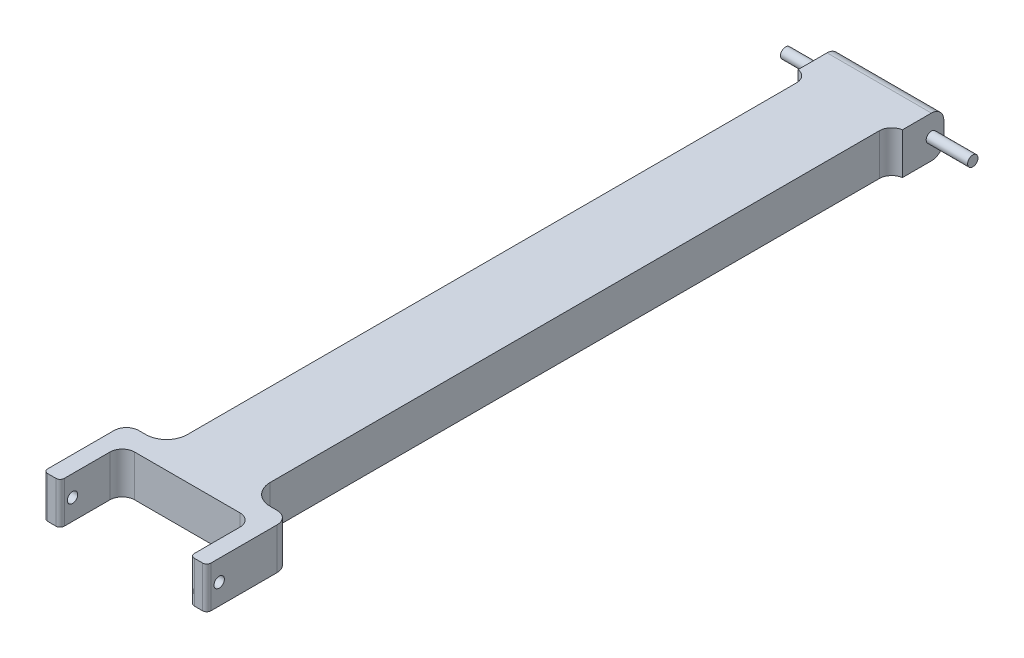
ISO-10303-21;
HEADER;
FILE_DESCRIPTION(('STEP AP214'),'2;1');
FILE_NAME('part.step','',(''),(''),'','','');
FILE_SCHEMA(('AUTOMOTIVE_DESIGN { 1 0 10303 214 1 1 1 1 }'));
ENDSEC;
DATA;
#1=APPLICATION_CONTEXT('core data for automotive mechanical design processes');
#2=APPLICATION_PROTOCOL_DEFINITION('international standard','automotive_design',2000,#1);
#3=PRODUCT_CONTEXT('',#1,'mechanical');
#4=PRODUCT('Part','Part','',(#3));
#5=PRODUCT_RELATED_PRODUCT_CATEGORY('part','',(#4));
#6=PRODUCT_DEFINITION_FORMATION('','',#4);
#7=PRODUCT_DEFINITION_CONTEXT('part definition',#1,'design');
#8=PRODUCT_DEFINITION('design','',#6,#7);
#9=PRODUCT_DEFINITION_SHAPE('','',#8);
#10=(LENGTH_UNIT() NAMED_UNIT(*) SI_UNIT(.MILLI.,.METRE.));
#11=(NAMED_UNIT(*) PLANE_ANGLE_UNIT() SI_UNIT($,.RADIAN.));
#12=(NAMED_UNIT(*) SI_UNIT($,.STERADIAN.) SOLID_ANGLE_UNIT());
#13=UNCERTAINTY_MEASURE_WITH_UNIT(LENGTH_MEASURE(1.E-05),#10,'distance_accuracy_value','');
#14=(GEOMETRIC_REPRESENTATION_CONTEXT(3) GLOBAL_UNCERTAINTY_ASSIGNED_CONTEXT((#13)) GLOBAL_UNIT_ASSIGNED_CONTEXT((#10,
#11,#12)) REPRESENTATION_CONTEXT('',''));
#15=CARTESIAN_POINT('',(0.,0.,0.));
#16=DIRECTION('',(0.,0.,1.));
#17=DIRECTION('',(1.,0.,0.));
#18=AXIS2_PLACEMENT_3D('',#15,#16,#17);
#19=CARTESIAN_POINT('',(29.695,10.,-165.));
#20=DIRECTION('',(-1.,0.,0.));
#21=DIRECTION('',(0.,0.,1.));
#22=AXIS2_PLACEMENT_3D('',#19,#20,#21);
#23=PLANE('',#22);
#24=DIRECTION('',(0.,0.,1.));
#25=VECTOR('',#24,1.);
#26=CARTESIAN_POINT('',(29.695,0.,-165.));
#27=LINE('',#26,#25);
#28=CARTESIAN_POINT('',(29.695,0.,-152.028148725121));
#29=VERTEX_POINT('',#28);
#30=CARTESIAN_POINT('',(29.695,0.,-5.));
#31=VERTEX_POINT('',#30);
#32=EDGE_CURVE('E335',#29,#31,#27,.T.);
#33=ORIENTED_EDGE('',*,*,#32,.F.);
#34=DIRECTION('',(0.,1.,0.));
#35=VECTOR('',#34,1.);
#36=CARTESIAN_POINT('',(29.695,10.,-152.028148725121));
#37=LINE('',#36,#35);
#38=CARTESIAN_POINT('',(29.695,10.,-152.028148725121));
#39=VERTEX_POINT('',#38);
#40=EDGE_CURVE('E548',#29,#39,#37,.T.);
#41=ORIENTED_EDGE('',*,*,#40,.T.);
#42=DIRECTION('',(0.,0.,1.));
#43=VECTOR('',#42,1.);
#44=CARTESIAN_POINT('',(29.695,10.,-165.));
#45=LINE('',#44,#43);
#46=CARTESIAN_POINT('',(29.695,10.,-5.));
#47=VERTEX_POINT('',#46);
#48=EDGE_CURVE('E298',#39,#47,#45,.T.);
#49=ORIENTED_EDGE('',*,*,#48,.T.);
#50=DIRECTION('',(0.,-1.,0.));
#51=VECTOR('',#50,1.);
#52=CARTESIAN_POINT('',(29.695,10.,-5.));
#53=LINE('',#52,#51);
#54=EDGE_CURVE('E525',#47,#31,#53,.T.);
#55=ORIENTED_EDGE('',*,*,#54,.T.);
#56=EDGE_LOOP('',(#33,#41,#49,#55));
#57=FACE_BOUND('',#56,.T.);
#58=ADVANCED_FACE('F38',(#57),#23,.F.);
#59=CARTESIAN_POINT('',(9.695,10.,-165.));
#60=DIRECTION('',(1.,0.,0.));
#61=DIRECTION('',(0.,0.,-1.));
#62=AXIS2_PLACEMENT_3D('',#59,#60,#61);
#63=PLANE('',#62);
#64=DIRECTION('',(0.,0.,1.));
#65=VECTOR('',#64,1.);
#66=CARTESIAN_POINT('',(9.695,10.,-165.));
#67=LINE('',#66,#65);
#68=CARTESIAN_POINT('',(9.695,10.,-152.028148725121));
#69=VERTEX_POINT('',#68);
#70=CARTESIAN_POINT('',(9.695,10.,-5.));
#71=VERTEX_POINT('',#70);
#72=EDGE_CURVE('E329',#69,#71,#67,.T.);
#73=ORIENTED_EDGE('',*,*,#72,.F.);
#74=DIRECTION('',(0.,-1.,0.));
#75=VECTOR('',#74,1.);
#76=CARTESIAN_POINT('',(9.695,10.,-152.028148725121));
#77=LINE('',#76,#75);
#78=CARTESIAN_POINT('',(9.695,0.,-152.028148725121));
#79=VERTEX_POINT('',#78);
#80=EDGE_CURVE('E545',#69,#79,#77,.T.);
#81=ORIENTED_EDGE('',*,*,#80,.T.);
#82=DIRECTION('',(0.,0.,1.));
#83=VECTOR('',#82,1.);
#84=CARTESIAN_POINT('',(9.695,0.,-165.));
#85=LINE('',#84,#83);
#86=CARTESIAN_POINT('',(9.695,0.,-5.));
#87=VERTEX_POINT('',#86);
#88=EDGE_CURVE('E332',#79,#87,#85,.T.);
#89=ORIENTED_EDGE('',*,*,#88,.T.);
#90=DIRECTION('',(0.,1.,0.));
#91=VECTOR('',#90,1.);
#92=CARTESIAN_POINT('',(9.695,10.,-5.));
#93=LINE('',#92,#91);
#94=EDGE_CURVE('E518',#87,#71,#93,.T.);
#95=ORIENTED_EDGE('',*,*,#94,.T.);
#96=EDGE_LOOP('',(#73,#81,#89,#95));
#97=FACE_BOUND('',#96,.T.);
#98=ADVANCED_FACE('F631',(#97),#63,.F.);
#99=CARTESIAN_POINT('',(0.,0.,0.));
#100=DIRECTION('',(0.,0.,-1.));
#101=DIRECTION('',(-1.,0.,0.));
#102=AXIS2_PLACEMENT_3D('',#99,#100,#101);
#103=PLANE('',#102);
#104=DIRECTION('',(1.,0.,0.));
#105=VECTOR('',#104,1.);
#106=CARTESIAN_POINT('',(0.,0.,0.));
#107=LINE('',#106,#105);
#108=CARTESIAN_POINT('',(34.695,0.,0.));
#109=VERTEX_POINT('',#108);
#110=CARTESIAN_POINT('',(36.39,0.,0.));
#111=VERTEX_POINT('',#110);
#112=EDGE_CURVE('E364',#109,#111,#107,.T.);
#113=ORIENTED_EDGE('',*,*,#112,.F.);
#114=DIRECTION('',(0.,-1.,0.));
#115=VECTOR('',#114,1.);
#116=CARTESIAN_POINT('',(34.695,0.,0.));
#117=LINE('',#116,#115);
#118=CARTESIAN_POINT('',(34.695,10.,0.));
#119=VERTEX_POINT('',#118);
#120=EDGE_CURVE('E529',#109,#119,#117,.F.);
#121=ORIENTED_EDGE('',*,*,#120,.T.);
#122=DIRECTION('',(-1.,0.,0.));
#123=VECTOR('',#122,1.);
#124=CARTESIAN_POINT('',(0.,10.,0.));
#125=LINE('',#124,#123);
#126=CARTESIAN_POINT('',(36.39,10.,0.));
#127=VERTEX_POINT('',#126);
#128=EDGE_CURVE('E381',#127,#119,#125,.T.);
#129=ORIENTED_EDGE('',*,*,#128,.F.);
#130=DIRECTION('',(0.,1.,0.));
#131=VECTOR('',#130,1.);
#132=CARTESIAN_POINT('',(36.39,0.,0.));
#133=LINE('',#132,#131);
#134=EDGE_CURVE('E425',#127,#111,#133,.F.);
#135=ORIENTED_EDGE('',*,*,#134,.T.);
#136=EDGE_LOOP('',(#113,#121,#129,#135));
#137=FACE_BOUND('',#136,.T.);
#138=ADVANCED_FACE('F637',(#137),#103,.T.);
#139=CARTESIAN_POINT('',(4.695,10.,0.));
#140=VERTEX_POINT('',#139);
#141=CARTESIAN_POINT('',(3.00000000000001,10.,0.));
#142=VERTEX_POINT('',#141);
#143=EDGE_CURVE('E392',#140,#142,#125,.T.);
#144=ORIENTED_EDGE('',*,*,#143,.F.);
#145=DIRECTION('',(0.,1.,0.));
#146=VECTOR('',#145,1.);
#147=CARTESIAN_POINT('',(4.695,0.,0.));
#148=LINE('',#147,#146);
#149=CARTESIAN_POINT('',(4.695,0.,0.));
#150=VERTEX_POINT('',#149);
#151=EDGE_CURVE('E522',#140,#150,#148,.F.);
#152=ORIENTED_EDGE('',*,*,#151,.T.);
#153=CARTESIAN_POINT('',(3.,0.,0.));
#154=VERTEX_POINT('',#153);
#155=EDGE_CURVE('E388',#154,#150,#107,.T.);
#156=ORIENTED_EDGE('',*,*,#155,.F.);
#157=DIRECTION('',(0.,-1.,0.));
#158=VECTOR('',#157,1.);
#159=CARTESIAN_POINT('',(3.00000000000001,10.,0.));
#160=LINE('',#159,#158);
#161=EDGE_CURVE('E421',#154,#142,#160,.F.);
#162=ORIENTED_EDGE('',*,*,#161,.T.);
#163=EDGE_LOOP('',(#144,#152,#156,#162));
#164=FACE_BOUND('',#163,.T.);
#165=ADVANCED_FACE('F668',(#164),#103,.T.);
#166=CARTESIAN_POINT('',(0.,0.,20.));
#167=DIRECTION('',(0.,0.,-1.));
#168=DIRECTION('',(-1.,0.,0.));
#169=AXIS2_PLACEMENT_3D('',#166,#167,#168);
#170=PLANE('',#169);
#171=DIRECTION('',(-1.,0.,0.));
#172=VECTOR('',#171,1.);
#173=CARTESIAN_POINT('',(0.,10.,20.));
#174=LINE('',#173,#172);
#175=CARTESIAN_POINT('',(3.,10.,20.));
#176=VERTEX_POINT('',#175);
#177=CARTESIAN_POINT('',(1.00000000000001,10.,20.));
#178=VERTEX_POINT('',#177);
#179=EDGE_CURVE('E387',#176,#178,#174,.T.);
#180=ORIENTED_EDGE('',*,*,#179,.T.);
#181=DIRECTION('',(0.,-1.,0.));
#182=VECTOR('',#181,1.);
#183=CARTESIAN_POINT('',(1.,0.,20.));
#184=LINE('',#183,#182);
#185=CARTESIAN_POINT('',(1.,0.,20.));
#186=VERTEX_POINT('',#185);
#187=EDGE_CURVE('E469',#178,#186,#184,.T.);
#188=ORIENTED_EDGE('',*,*,#187,.T.);
#189=DIRECTION('',(1.,0.,0.));
#190=VECTOR('',#189,1.);
#191=CARTESIAN_POINT('',(0.,0.,20.));
#192=LINE('',#191,#190);
#193=CARTESIAN_POINT('',(3.,0.,20.));
#194=VERTEX_POINT('',#193);
#195=EDGE_CURVE('E380',#186,#194,#192,.T.);
#196=ORIENTED_EDGE('',*,*,#195,.T.);
#197=DIRECTION('',(0.,-1.,0.));
#198=VECTOR('',#197,1.);
#199=CARTESIAN_POINT('',(3.,0.,20.));
#200=LINE('',#199,#198);
#201=EDGE_CURVE('E466',#194,#176,#200,.F.);
#202=ORIENTED_EDGE('',*,*,#201,.T.);
#203=EDGE_LOOP('',(#180,#188,#196,#202));
#204=FACE_BOUND('',#203,.T.);
#205=ADVANCED_FACE('F665',(#204),#170,.F.);
#206=CARTESIAN_POINT('',(0.,0.,20.));
#207=DIRECTION('',(1.,0.,0.));
#208=DIRECTION('',(0.,1.,0.));
#209=AXIS2_PLACEMENT_3D('',#206,#207,#208);
#210=PLANE('',#209);
#211=CARTESIAN_POINT('',(0.,5.,17.));
#212=DIRECTION('',(1.,0.,0.));
#213=DIRECTION('',(0.,1.,0.));
#214=AXIS2_PLACEMENT_3D('',#211,#212,#213);
#215=CIRCLE('',#214,1.25);
#216=CARTESIAN_POINT('',(0.,6.25,17.));
#217=VERTEX_POINT('',#216);
#218=EDGE_CURVE('E347',#217,#217,#215,.T.);
#219=ORIENTED_EDGE('',*,*,#218,.T.);
#220=EDGE_LOOP('',(#219));
#221=FACE_BOUND('',#220,.T.);
#222=DIRECTION('',(0.,0.,-1.));
#223=VECTOR('',#222,1.);
#224=CARTESIAN_POINT('',(0.,0.,20.));
#225=LINE('',#224,#223);
#226=CARTESIAN_POINT('',(0.,0.,19.));
#227=VERTEX_POINT('',#226);
#228=CARTESIAN_POINT('',(0.,0.,3.));
#229=VERTEX_POINT('',#228);
#230=EDGE_CURVE('E404',#227,#229,#225,.T.);
#231=ORIENTED_EDGE('',*,*,#230,.F.);
#232=DIRECTION('',(0.,-1.,0.));
#233=VECTOR('',#232,1.);
#234=CARTESIAN_POINT('',(0.,0.,19.));
#235=LINE('',#234,#233);
#236=CARTESIAN_POINT('',(0.,10.,19.));
#237=VERTEX_POINT('',#236);
#238=EDGE_CURVE('E485',#227,#237,#235,.F.);
#239=ORIENTED_EDGE('',*,*,#238,.T.);
#240=DIRECTION('',(0.,0.,-1.));
#241=VECTOR('',#240,1.);
#242=CARTESIAN_POINT('',(0.,10.,20.));
#243=LINE('',#242,#241);
#244=CARTESIAN_POINT('',(0.,10.,3.));
#245=VERTEX_POINT('',#244);
#246=EDGE_CURVE('E386',#237,#245,#243,.T.);
#247=ORIENTED_EDGE('',*,*,#246,.T.);
#248=DIRECTION('',(0.,-1.,0.));
#249=VECTOR('',#248,1.);
#250=CARTESIAN_POINT('',(0.,0.,3.));
#251=LINE('',#250,#249);
#252=EDGE_CURVE('E436',#245,#229,#251,.T.);
#253=ORIENTED_EDGE('',*,*,#252,.T.);
#254=EDGE_LOOP('',(#231,#239,#247,#253));
#255=FACE_BOUND('',#254,.T.);
#256=ADVANCED_FACE('F679',(#221,#255),#210,.F.);
#257=CARTESIAN_POINT('',(0.,0.,20.));
#258=DIRECTION('',(0.,1.,0.));
#259=DIRECTION('',(0.,0.,1.));
#260=AXIS2_PLACEMENT_3D('',#257,#258,#259);
#261=PLANE('',#260);
#262=DIRECTION('',(0.,0.,1.));
#263=VECTOR('',#262,1.);
#264=CARTESIAN_POINT('',(7.105,0.,-165.));
#265=LINE('',#264,#263);
#266=CARTESIAN_POINT('',(7.105,0.,-162.));
#267=VERTEX_POINT('',#266);
#268=CARTESIAN_POINT('',(7.105,0.,-155.));
#269=VERTEX_POINT('',#268);
#270=EDGE_CURVE('E317',#267,#269,#265,.T.);
#271=ORIENTED_EDGE('',*,*,#270,.F.);
#272=DIRECTION('',(-1.,0.,0.));
#273=VECTOR('',#272,1.);
#274=CARTESIAN_POINT('',(32.285,0.,-162.));
#275=LINE('',#274,#273);
#276=CARTESIAN_POINT('',(32.285,0.,-162.));
#277=VERTEX_POINT('',#276);
#278=EDGE_CURVE('E578',#267,#277,#275,.F.);
#279=ORIENTED_EDGE('',*,*,#278,.T.);
#280=DIRECTION('',(0.,0.,-1.));
#281=VECTOR('',#280,1.);
#282=CARTESIAN_POINT('',(32.285,0.,-165.));
#283=LINE('',#282,#281);
#284=CARTESIAN_POINT('',(32.285,0.,-155.));
#285=VERTEX_POINT('',#284);
#286=EDGE_CURVE('E307',#285,#277,#283,.T.);
#287=ORIENTED_EDGE('',*,*,#286,.F.);
#288=CARTESIAN_POINT('',(32.695,0.,-152.028148725121));
#289=DIRECTION('',(0.,1.,0.));
#290=DIRECTION('',(0.,0.,1.));
#291=AXIS2_PLACEMENT_3D('',#288,#289,#290);
#292=CIRCLE('',#291,3.);
#293=EDGE_CURVE('E303',#285,#29,#292,.T.);
#294=ORIENTED_EDGE('',*,*,#293,.T.);
#295=ORIENTED_EDGE('',*,*,#32,.T.);
#296=CARTESIAN_POINT('',(34.695,0.,-5.));
#297=DIRECTION('',(0.,1.,0.));
#298=DIRECTION('',(0.,0.,1.));
#299=AXIS2_PLACEMENT_3D('',#296,#297,#298);
#300=CIRCLE('',#299,5.);
#301=EDGE_CURVE('E539',#31,#109,#300,.T.);
#302=ORIENTED_EDGE('',*,*,#301,.T.);
#303=ORIENTED_EDGE('',*,*,#112,.T.);
#304=CARTESIAN_POINT('',(36.39,0.,3.));
#305=DIRECTION('',(0.,1.,0.));
#306=DIRECTION('',(0.,0.,1.));
#307=AXIS2_PLACEMENT_3D('',#304,#305,#306);
#308=CIRCLE('',#307,3.);
#309=CARTESIAN_POINT('',(39.39,0.,3.));
#310=VERTEX_POINT('',#309);
#311=EDGE_CURVE('E432',#111,#310,#308,.F.);
#312=ORIENTED_EDGE('',*,*,#311,.T.);
#313=DIRECTION('',(0.,0.,-1.));
#314=VECTOR('',#313,1.);
#315=CARTESIAN_POINT('',(39.39,0.,20.));
#316=LINE('',#315,#314);
#317=CARTESIAN_POINT('',(39.39,0.,19.));
#318=VERTEX_POINT('',#317);
#319=EDGE_CURVE('E401',#318,#310,#316,.T.);
#320=ORIENTED_EDGE('',*,*,#319,.F.);
#321=CARTESIAN_POINT('',(38.39,0.,19.));
#322=DIRECTION('',(0.,1.,0.));
#323=DIRECTION('',(0.,0.,1.));
#324=AXIS2_PLACEMENT_3D('',#321,#322,#323);
#325=CIRCLE('',#324,1.);
#326=CARTESIAN_POINT('',(38.39,0.,20.));
#327=VERTEX_POINT('',#326);
#328=EDGE_CURVE('E473',#318,#327,#325,.F.);
#329=ORIENTED_EDGE('',*,*,#328,.T.);
#330=CARTESIAN_POINT('',(36.39,0.,20.));
#331=VERTEX_POINT('',#330);
#332=EDGE_CURVE('E376',#331,#327,#192,.T.);
#333=ORIENTED_EDGE('',*,*,#332,.F.);
#334=CARTESIAN_POINT('',(36.39,0.,19.));
#335=DIRECTION('',(0.,1.,0.));
#336=DIRECTION('',(0.,0.,1.));
#337=AXIS2_PLACEMENT_3D('',#334,#335,#336);
#338=CIRCLE('',#337,1.);
#339=CARTESIAN_POINT('',(35.39,0.,19.));
#340=VERTEX_POINT('',#339);
#341=EDGE_CURVE('E476',#331,#340,#338,.F.);
#342=ORIENTED_EDGE('',*,*,#341,.T.);
#343=DIRECTION('',(0.,0.,1.));
#344=VECTOR('',#343,1.);
#345=CARTESIAN_POINT('',(35.39,0.,5.));
#346=LINE('',#345,#344);
#347=CARTESIAN_POINT('',(35.39,0.,8.));
#348=VERTEX_POINT('',#347);
#349=EDGE_CURVE('E369',#348,#340,#346,.T.);
#350=ORIENTED_EDGE('',*,*,#349,.F.);
#351=CARTESIAN_POINT('',(32.39,0.,8.));
#352=DIRECTION('',(0.,1.,0.));
#353=DIRECTION('',(0.,0.,1.));
#354=AXIS2_PLACEMENT_3D('',#351,#352,#353);
#355=CIRCLE('',#354,3.);
#356=CARTESIAN_POINT('',(32.39,0.,5.));
#357=VERTEX_POINT('',#356);
#358=EDGE_CURVE('E463',#348,#357,#355,.T.);
#359=ORIENTED_EDGE('',*,*,#358,.T.);
#360=DIRECTION('',(1.,0.,0.));
#361=VECTOR('',#360,1.);
#362=CARTESIAN_POINT('',(4.,0.,5.));
#363=LINE('',#362,#361);
#364=CARTESIAN_POINT('',(7.,0.,5.));
#365=VERTEX_POINT('',#364);
#366=EDGE_CURVE('E351',#365,#357,#363,.T.);
#367=ORIENTED_EDGE('',*,*,#366,.F.);
#368=CARTESIAN_POINT('',(7.,0.,8.));
#369=DIRECTION('',(0.,1.,0.));
#370=DIRECTION('',(0.,0.,1.));
#371=AXIS2_PLACEMENT_3D('',#368,#369,#370);
#372=CIRCLE('',#371,3.);
#373=CARTESIAN_POINT('',(4.,0.,8.));
#374=VERTEX_POINT('',#373);
#375=EDGE_CURVE('E454',#365,#374,#372,.T.);
#376=ORIENTED_EDGE('',*,*,#375,.T.);
#377=DIRECTION('',(0.,0.,1.));
#378=VECTOR('',#377,1.);
#379=CARTESIAN_POINT('',(4.,0.,5.));
#380=LINE('',#379,#378);
#381=CARTESIAN_POINT('',(4.,0.,19.));
#382=VERTEX_POINT('',#381);
#383=EDGE_CURVE('E359',#374,#382,#380,.T.);
#384=ORIENTED_EDGE('',*,*,#383,.T.);
#385=CARTESIAN_POINT('',(3.,0.,19.));
#386=DIRECTION('',(0.,1.,0.));
#387=DIRECTION('',(0.,0.,1.));
#388=AXIS2_PLACEMENT_3D('',#385,#386,#387);
#389=CIRCLE('',#388,1.);
#390=EDGE_CURVE('E479',#382,#194,#389,.F.);
#391=ORIENTED_EDGE('',*,*,#390,.T.);
#392=ORIENTED_EDGE('',*,*,#195,.F.);
#393=CARTESIAN_POINT('',(1.,0.,19.));
#394=DIRECTION('',(0.,1.,0.));
#395=DIRECTION('',(0.,0.,1.));
#396=AXIS2_PLACEMENT_3D('',#393,#394,#395);
#397=CIRCLE('',#396,1.);
#398=EDGE_CURVE('E482',#186,#227,#397,.F.);
#399=ORIENTED_EDGE('',*,*,#398,.T.);
#400=ORIENTED_EDGE('',*,*,#230,.T.);
#401=CARTESIAN_POINT('',(3.,0.,3.));
#402=DIRECTION('',(0.,1.,0.));
#403=DIRECTION('',(0.,0.,1.));
#404=AXIS2_PLACEMENT_3D('',#401,#402,#403);
#405=CIRCLE('',#404,3.);
#406=EDGE_CURVE('E429',#229,#154,#405,.F.);
#407=ORIENTED_EDGE('',*,*,#406,.T.);
#408=ORIENTED_EDGE('',*,*,#155,.T.);
#409=CARTESIAN_POINT('',(4.695,0.,-5.));
#410=DIRECTION('',(0.,1.,0.));
#411=DIRECTION('',(0.,0.,1.));
#412=AXIS2_PLACEMENT_3D('',#409,#410,#411);
#413=CIRCLE('',#412,5.);
#414=EDGE_CURVE('E535',#150,#87,#413,.T.);
#415=ORIENTED_EDGE('',*,*,#414,.T.);
#416=ORIENTED_EDGE('',*,*,#88,.F.);
#417=CARTESIAN_POINT('',(6.695,0.,-152.028148725121));
#418=DIRECTION('',(0.,1.,0.));
#419=DIRECTION('',(0.,0.,1.));
#420=AXIS2_PLACEMENT_3D('',#417,#418,#419);
#421=CIRCLE('',#420,3.);
#422=EDGE_CURVE('E554',#79,#269,#421,.T.);
#423=ORIENTED_EDGE('',*,*,#422,.T.);
#424=EDGE_LOOP('',(#271,#279,#287,#294,#295,#302,#303,#312,#320,#329,#333,#342,#350,#359,#367,
#376,#384,#391,#392,#399,#400,#407,#408,#415,#416,#423));
#425=FACE_BOUND('',#424,.T.);
#426=ADVANCED_FACE('F675',(#425),#261,.F.);
#427=CARTESIAN_POINT('',(39.39,0.,20.));
#428=DIRECTION('',(-1.,0.,0.));
#429=DIRECTION('',(0.,-1.,0.));
#430=AXIS2_PLACEMENT_3D('',#427,#428,#429);
#431=PLANE('',#430);
#432=CARTESIAN_POINT('',(39.39,4.99999999999997,17.));
#433=DIRECTION('',(-1.,0.,0.));
#434=DIRECTION('',(0.,-1.,0.));
#435=AXIS2_PLACEMENT_3D('',#432,#433,#434);
#436=CIRCLE('',#435,1.25);
#437=CARTESIAN_POINT('',(39.39,3.74999999999997,17.));
#438=VERTEX_POINT('',#437);
#439=EDGE_CURVE('E338',#438,#438,#436,.T.);
#440=ORIENTED_EDGE('',*,*,#439,.T.);
#441=EDGE_LOOP('',(#440));
#442=FACE_BOUND('',#441,.T.);
#443=DIRECTION('',(0.,0.,-1.));
#444=VECTOR('',#443,1.);
#445=CARTESIAN_POINT('',(39.39,10.,20.));
#446=LINE('',#445,#444);
#447=CARTESIAN_POINT('',(39.39,10.,19.));
#448=VERTEX_POINT('',#447);
#449=CARTESIAN_POINT('',(39.39,10.,3.));
#450=VERTEX_POINT('',#449);
#451=EDGE_CURVE('E398',#448,#450,#446,.T.);
#452=ORIENTED_EDGE('',*,*,#451,.F.);
#453=DIRECTION('',(0.,1.,0.));
#454=VECTOR('',#453,1.);
#455=CARTESIAN_POINT('',(39.39,0.,19.));
#456=LINE('',#455,#454);
#457=EDGE_CURVE('E515',#448,#318,#456,.F.);
#458=ORIENTED_EDGE('',*,*,#457,.T.);
#459=ORIENTED_EDGE('',*,*,#319,.T.);
#460=DIRECTION('',(0.,1.,0.));
#461=VECTOR('',#460,1.);
#462=CARTESIAN_POINT('',(39.39,10.,3.));
#463=LINE('',#462,#461);
#464=EDGE_CURVE('E407',#310,#450,#463,.T.);
#465=ORIENTED_EDGE('',*,*,#464,.T.);
#466=EDGE_LOOP('',(#452,#458,#459,#465));
#467=FACE_BOUND('',#466,.T.);
#468=ADVANCED_FACE('F672',(#442,#467),#431,.F.);
#469=CARTESIAN_POINT('',(0.,10.,20.));
#470=DIRECTION('',(0.,-1.,0.));
#471=DIRECTION('',(0.,0.,-1.));
#472=AXIS2_PLACEMENT_3D('',#469,#470,#471);
#473=PLANE('',#472);
#474=DIRECTION('',(0.,0.,1.));
#475=VECTOR('',#474,1.);
#476=CARTESIAN_POINT('',(32.285,10.,-165.));
#477=LINE('',#476,#475);
#478=CARTESIAN_POINT('',(32.285,10.,-162.));
#479=VERTEX_POINT('',#478);
#480=CARTESIAN_POINT('',(32.285,10.,-155.));
#481=VERTEX_POINT('',#480);
#482=EDGE_CURVE('E281',#479,#481,#477,.T.);
#483=ORIENTED_EDGE('',*,*,#482,.F.);
#484=DIRECTION('',(1.,0.,0.));
#485=VECTOR('',#484,1.);
#486=CARTESIAN_POINT('',(7.105,10.,-162.));
#487=LINE('',#486,#485);
#488=CARTESIAN_POINT('',(7.105,10.,-162.));
#489=VERTEX_POINT('',#488);
#490=EDGE_CURVE('E68',#479,#489,#487,.F.);
#491=ORIENTED_EDGE('',*,*,#490,.T.);
#492=DIRECTION('',(0.,0.,-1.));
#493=VECTOR('',#492,1.);
#494=CARTESIAN_POINT('',(7.105,10.,-165.));
#495=LINE('',#494,#493);
#496=CARTESIAN_POINT('',(7.105,10.,-155.));
#497=VERTEX_POINT('',#496);
#498=EDGE_CURVE('E324',#497,#489,#495,.T.);
#499=ORIENTED_EDGE('',*,*,#498,.F.);
#500=CARTESIAN_POINT('',(6.695,10.,-152.028148725121));
#501=DIRECTION('',(0.,-1.,0.));
#502=DIRECTION('',(0.,0.,-1.));
#503=AXIS2_PLACEMENT_3D('',#500,#501,#502);
#504=CIRCLE('',#503,3.);
#505=EDGE_CURVE('E551',#497,#69,#504,.T.);
#506=ORIENTED_EDGE('',*,*,#505,.T.);
#507=ORIENTED_EDGE('',*,*,#72,.T.);
#508=CARTESIAN_POINT('',(4.695,10.,-5.));
#509=DIRECTION('',(0.,-1.,0.));
#510=DIRECTION('',(0.,0.,-1.));
#511=AXIS2_PLACEMENT_3D('',#508,#509,#510);
#512=CIRCLE('',#511,5.);
#513=EDGE_CURVE('E532',#71,#140,#512,.T.);
#514=ORIENTED_EDGE('',*,*,#513,.T.);
#515=ORIENTED_EDGE('',*,*,#143,.T.);
#516=CARTESIAN_POINT('',(3.00000000000001,10.,3.));
#517=DIRECTION('',(0.,-1.,0.));
#518=DIRECTION('',(0.,0.,-1.));
#519=AXIS2_PLACEMENT_3D('',#516,#517,#518);
#520=CIRCLE('',#519,3.);
#521=EDGE_CURVE('E414',#142,#245,#520,.F.);
#522=ORIENTED_EDGE('',*,*,#521,.T.);
#523=ORIENTED_EDGE('',*,*,#246,.F.);
#524=CARTESIAN_POINT('',(1.00000000000001,10.,19.));
#525=DIRECTION('',(0.,-1.,0.));
#526=DIRECTION('',(0.,0.,-1.));
#527=AXIS2_PLACEMENT_3D('',#524,#525,#526);
#528=CIRCLE('',#527,1.);
#529=EDGE_CURVE('E497',#237,#178,#528,.F.);
#530=ORIENTED_EDGE('',*,*,#529,.T.);
#531=ORIENTED_EDGE('',*,*,#179,.F.);
#532=CARTESIAN_POINT('',(3.,10.,19.));
#533=DIRECTION('',(0.,-1.,0.));
#534=DIRECTION('',(0.,0.,-1.));
#535=AXIS2_PLACEMENT_3D('',#532,#533,#534);
#536=CIRCLE('',#535,1.);
#537=CARTESIAN_POINT('',(4.,10.,19.));
#538=VERTEX_POINT('',#537);
#539=EDGE_CURVE('E494',#176,#538,#536,.F.);
#540=ORIENTED_EDGE('',*,*,#539,.T.);
#541=DIRECTION('',(0.,0.,1.));
#542=VECTOR('',#541,1.);
#543=CARTESIAN_POINT('',(4.,10.,5.));
#544=LINE('',#543,#542);
#545=CARTESIAN_POINT('',(4.,10.,8.));
#546=VERTEX_POINT('',#545);
#547=EDGE_CURVE('E360',#546,#538,#544,.T.);
#548=ORIENTED_EDGE('',*,*,#547,.F.);
#549=CARTESIAN_POINT('',(7.,10.,8.));
#550=DIRECTION('',(0.,-1.,0.));
#551=DIRECTION('',(0.,0.,-1.));
#552=AXIS2_PLACEMENT_3D('',#549,#550,#551);
#553=CIRCLE('',#552,3.);
#554=CARTESIAN_POINT('',(7.,10.,5.));
#555=VERTEX_POINT('',#554);
#556=EDGE_CURVE('E457',#546,#555,#553,.T.);
#557=ORIENTED_EDGE('',*,*,#556,.T.);
#558=DIRECTION('',(-1.,0.,0.));
#559=VECTOR('',#558,1.);
#560=CARTESIAN_POINT('',(4.,10.,5.));
#561=LINE('',#560,#559);
#562=CARTESIAN_POINT('',(32.39,10.,5.));
#563=VERTEX_POINT('',#562);
#564=EDGE_CURVE('E355',#563,#555,#561,.T.);
#565=ORIENTED_EDGE('',*,*,#564,.F.);
#566=CARTESIAN_POINT('',(32.39,10.,8.));
#567=DIRECTION('',(0.,-1.,0.));
#568=DIRECTION('',(0.,0.,-1.));
#569=AXIS2_PLACEMENT_3D('',#566,#567,#568);
#570=CIRCLE('',#569,3.);
#571=CARTESIAN_POINT('',(35.39,10.,8.));
#572=VERTEX_POINT('',#571);
#573=EDGE_CURVE('E460',#563,#572,#570,.T.);
#574=ORIENTED_EDGE('',*,*,#573,.T.);
#575=DIRECTION('',(0.,0.,1.));
#576=VECTOR('',#575,1.);
#577=CARTESIAN_POINT('',(35.39,10.,5.));
#578=LINE('',#577,#576);
#579=CARTESIAN_POINT('',(35.39,10.,19.));
#580=VERTEX_POINT('',#579);
#581=EDGE_CURVE('E365',#572,#580,#578,.T.);
#582=ORIENTED_EDGE('',*,*,#581,.T.);
#583=CARTESIAN_POINT('',(36.39,10.,19.));
#584=DIRECTION('',(0.,-1.,0.));
#585=DIRECTION('',(0.,0.,-1.));
#586=AXIS2_PLACEMENT_3D('',#583,#584,#585);
#587=CIRCLE('',#586,1.);
#588=CARTESIAN_POINT('',(36.39,10.,20.));
#589=VERTEX_POINT('',#588);
#590=EDGE_CURVE('E491',#580,#589,#587,.F.);
#591=ORIENTED_EDGE('',*,*,#590,.T.);
#592=CARTESIAN_POINT('',(38.39,10.,20.));
#593=VERTEX_POINT('',#592);
#594=EDGE_CURVE('E382',#593,#589,#174,.T.);
#595=ORIENTED_EDGE('',*,*,#594,.F.);
#596=CARTESIAN_POINT('',(38.39,10.,19.));
#597=DIRECTION('',(0.,-1.,0.));
#598=DIRECTION('',(0.,0.,-1.));
#599=AXIS2_PLACEMENT_3D('',#596,#597,#598);
#600=CIRCLE('',#599,1.);
#601=EDGE_CURVE('E488',#593,#448,#600,.F.);
#602=ORIENTED_EDGE('',*,*,#601,.T.);
#603=ORIENTED_EDGE('',*,*,#451,.T.);
#604=CARTESIAN_POINT('',(36.39,10.,3.));
#605=DIRECTION('',(0.,-1.,0.));
#606=DIRECTION('',(0.,0.,-1.));
#607=AXIS2_PLACEMENT_3D('',#604,#605,#606);
#608=CIRCLE('',#607,3.);
#609=EDGE_CURVE('E418',#450,#127,#608,.F.);
#610=ORIENTED_EDGE('',*,*,#609,.T.);
#611=ORIENTED_EDGE('',*,*,#128,.T.);
#612=CARTESIAN_POINT('',(34.695,10.,-5.));
#613=DIRECTION('',(0.,-1.,0.));
#614=DIRECTION('',(0.,0.,-1.));
#615=AXIS2_PLACEMENT_3D('',#612,#613,#614);
#616=CIRCLE('',#615,5.);
#617=EDGE_CURVE('E542',#119,#47,#616,.T.);
#618=ORIENTED_EDGE('',*,*,#617,.T.);
#619=ORIENTED_EDGE('',*,*,#48,.F.);
#620=CARTESIAN_POINT('',(32.695,10.,-152.028148725121));
#621=DIRECTION('',(0.,-1.,0.));
#622=DIRECTION('',(0.,0.,-1.));
#623=AXIS2_PLACEMENT_3D('',#620,#621,#622);
#624=CIRCLE('',#623,3.);
#625=EDGE_CURVE('E295',#39,#481,#624,.T.);
#626=ORIENTED_EDGE('',*,*,#625,.T.);
#627=EDGE_LOOP('',(#483,#491,#499,#506,#507,#514,#515,#522,#523,#530,#531,#540,#548,#557,#565,
#574,#582,#591,#595,#602,#603,#610,#611,#618,#619,#626));
#628=FACE_BOUND('',#627,.T.);
#629=ADVANCED_FACE('F296',(#628),#473,.F.);
#630=ORIENTED_EDGE('',*,*,#594,.T.);
#631=DIRECTION('',(0.,1.,0.));
#632=VECTOR('',#631,1.);
#633=CARTESIAN_POINT('',(36.39,0.,20.));
#634=LINE('',#633,#632);
#635=EDGE_CURVE('E512',#589,#331,#634,.F.);
#636=ORIENTED_EDGE('',*,*,#635,.T.);
#637=ORIENTED_EDGE('',*,*,#332,.T.);
#638=DIRECTION('',(0.,1.,0.));
#639=VECTOR('',#638,1.);
#640=CARTESIAN_POINT('',(38.39,0.,20.));
#641=LINE('',#640,#639);
#642=EDGE_CURVE('E508',#327,#593,#641,.T.);
#643=ORIENTED_EDGE('',*,*,#642,.T.);
#644=EDGE_LOOP('',(#630,#636,#637,#643));
#645=FACE_BOUND('',#644,.T.);
#646=ADVANCED_FACE('F660',(#645),#170,.F.);
#647=CARTESIAN_POINT('',(4.,0.,5.));
#648=DIRECTION('',(-1.,0.,0.));
#649=DIRECTION('',(0.,0.,1.));
#650=AXIS2_PLACEMENT_3D('',#647,#648,#649);
#651=PLANE('',#650);
#652=CARTESIAN_POINT('',(4.,5.,17.));
#653=DIRECTION('',(-1.,0.,0.));
#654=DIRECTION('',(0.,0.,1.));
#655=AXIS2_PLACEMENT_3D('',#652,#653,#654);
#656=CIRCLE('',#655,1.25);
#657=CARTESIAN_POINT('',(4.,5.,18.25));
#658=VERTEX_POINT('',#657);
#659=EDGE_CURVE('E343',#658,#658,#656,.T.);
#660=ORIENTED_EDGE('',*,*,#659,.T.);
#661=EDGE_LOOP('',(#660));
#662=FACE_BOUND('',#661,.T.);
#663=ORIENTED_EDGE('',*,*,#547,.T.);
#664=DIRECTION('',(0.,-1.,0.));
#665=VECTOR('',#664,1.);
#666=CARTESIAN_POINT('',(4.,0.,19.));
#667=LINE('',#666,#665);
#668=EDGE_CURVE('E500',#538,#382,#667,.T.);
#669=ORIENTED_EDGE('',*,*,#668,.T.);
#670=ORIENTED_EDGE('',*,*,#383,.F.);
#671=DIRECTION('',(0.,-1.,0.));
#672=VECTOR('',#671,1.);
#673=CARTESIAN_POINT('',(4.,10.,8.));
#674=LINE('',#673,#672);
#675=EDGE_CURVE('E448',#374,#546,#674,.F.);
#676=ORIENTED_EDGE('',*,*,#675,.T.);
#677=EDGE_LOOP('',(#663,#669,#670,#676));
#678=FACE_BOUND('',#677,.T.);
#679=ADVANCED_FACE('F656',(#662,#678),#651,.F.);
#680=CARTESIAN_POINT('',(35.39,0.,5.));
#681=DIRECTION('',(1.,0.,0.));
#682=DIRECTION('',(0.,0.,-1.));
#683=AXIS2_PLACEMENT_3D('',#680,#681,#682);
#684=PLANE('',#683);
#685=CARTESIAN_POINT('',(35.39,4.99999999999998,17.));
#686=DIRECTION('',(1.,0.,0.));
#687=DIRECTION('',(0.,0.,-1.));
#688=AXIS2_PLACEMENT_3D('',#685,#686,#687);
#689=CIRCLE('',#688,1.25);
#690=CARTESIAN_POINT('',(35.39,4.99999999999998,15.75));
#691=VERTEX_POINT('',#690);
#692=EDGE_CURVE('E342',#691,#691,#689,.T.);
#693=ORIENTED_EDGE('',*,*,#692,.T.);
#694=EDGE_LOOP('',(#693));
#695=FACE_BOUND('',#694,.T.);
#696=ORIENTED_EDGE('',*,*,#349,.T.);
#697=DIRECTION('',(0.,1.,0.));
#698=VECTOR('',#697,1.);
#699=CARTESIAN_POINT('',(35.39,0.,19.));
#700=LINE('',#699,#698);
#701=EDGE_CURVE('E504',#340,#580,#700,.T.);
#702=ORIENTED_EDGE('',*,*,#701,.T.);
#703=ORIENTED_EDGE('',*,*,#581,.F.);
#704=DIRECTION('',(0.,1.,0.));
#705=VECTOR('',#704,1.);
#706=CARTESIAN_POINT('',(35.39,0.,8.));
#707=LINE('',#706,#705);
#708=EDGE_CURVE('E451',#572,#348,#707,.F.);
#709=ORIENTED_EDGE('',*,*,#708,.T.);
#710=EDGE_LOOP('',(#696,#702,#703,#709));
#711=FACE_BOUND('',#710,.T.);
#712=ADVANCED_FACE('F652',(#695,#711),#684,.F.);
#713=CARTESIAN_POINT('',(0.,0.,5.));
#714=DIRECTION('',(0.,0.,-1.));
#715=DIRECTION('',(-1.,0.,0.));
#716=AXIS2_PLACEMENT_3D('',#713,#714,#715);
#717=PLANE('',#716);
#718=ORIENTED_EDGE('',*,*,#564,.T.);
#719=DIRECTION('',(0.,-1.,0.));
#720=VECTOR('',#719,1.);
#721=CARTESIAN_POINT('',(7.,0.,5.));
#722=LINE('',#721,#720);
#723=EDGE_CURVE('E444',#555,#365,#722,.T.);
#724=ORIENTED_EDGE('',*,*,#723,.T.);
#725=ORIENTED_EDGE('',*,*,#366,.T.);
#726=DIRECTION('',(0.,1.,0.));
#727=VECTOR('',#726,1.);
#728=CARTESIAN_POINT('',(32.39,10.,5.));
#729=LINE('',#728,#727);
#730=EDGE_CURVE('E440',#357,#563,#729,.T.);
#731=ORIENTED_EDGE('',*,*,#730,.T.);
#732=EDGE_LOOP('',(#718,#724,#725,#731));
#733=FACE_BOUND('',#732,.T.);
#734=ADVANCED_FACE('F649',(#733),#717,.F.);
#735=CARTESIAN_POINT('',(39.39,4.99999999999997,17.));
#736=DIRECTION('',(-1.,0.,0.));
#737=DIRECTION('',(0.,-1.,0.));
#738=AXIS2_PLACEMENT_3D('',#735,#736,#737);
#739=CYLINDRICAL_SURFACE('',#738,1.25);
#740=ORIENTED_EDGE('',*,*,#439,.F.);
#741=EDGE_LOOP('',(#740));
#742=FACE_BOUND('',#741,.T.);
#743=ORIENTED_EDGE('',*,*,#692,.F.);
#744=EDGE_LOOP('',(#743));
#745=FACE_BOUND('',#744,.T.);
#746=ADVANCED_FACE('F647',(#742,#745),#739,.F.);
#747=ORIENTED_EDGE('',*,*,#659,.F.);
#748=EDGE_LOOP('',(#747));
#749=FACE_BOUND('',#748,.T.);
#750=ORIENTED_EDGE('',*,*,#218,.F.);
#751=EDGE_LOOP('',(#750));
#752=FACE_BOUND('',#751,.T.);
#753=ADVANCED_FACE('F643',(#749,#752),#739,.F.);
#754=CARTESIAN_POINT('',(36.39,0.,3.));
#755=DIRECTION('',(0.,-1.,0.));
#756=DIRECTION('',(1.,0.,0.));
#757=AXIS2_PLACEMENT_3D('',#754,#755,#756);
#758=CYLINDRICAL_SURFACE('',#757,3.);
#759=ORIENTED_EDGE('',*,*,#311,.F.);
#760=ORIENTED_EDGE('',*,*,#134,.F.);
#761=ORIENTED_EDGE('',*,*,#609,.F.);
#762=ORIENTED_EDGE('',*,*,#464,.F.);
#763=EDGE_LOOP('',(#759,#760,#761,#762));
#764=FACE_BOUND('',#763,.T.);
#765=ADVANCED_FACE('F646',(#764),#758,.T.);
#766=CARTESIAN_POINT('',(3.,0.,3.));
#767=DIRECTION('',(0.,1.,0.));
#768=DIRECTION('',(-1.,0.,0.));
#769=AXIS2_PLACEMENT_3D('',#766,#767,#768);
#770=CYLINDRICAL_SURFACE('',#769,3.);
#771=ORIENTED_EDGE('',*,*,#521,.F.);
#772=ORIENTED_EDGE('',*,*,#161,.F.);
#773=ORIENTED_EDGE('',*,*,#406,.F.);
#774=ORIENTED_EDGE('',*,*,#252,.F.);
#775=EDGE_LOOP('',(#771,#772,#773,#774));
#776=FACE_BOUND('',#775,.T.);
#777=ADVANCED_FACE('F686',(#776),#770,.T.);
#778=CARTESIAN_POINT('',(7.,0.,8.));
#779=DIRECTION('',(0.,1.,0.));
#780=DIRECTION('',(0.,0.,1.));
#781=AXIS2_PLACEMENT_3D('',#778,#779,#780);
#782=CYLINDRICAL_SURFACE('',#781,3.);
#783=ORIENTED_EDGE('',*,*,#556,.F.);
#784=ORIENTED_EDGE('',*,*,#675,.F.);
#785=ORIENTED_EDGE('',*,*,#375,.F.);
#786=ORIENTED_EDGE('',*,*,#723,.F.);
#787=EDGE_LOOP('',(#783,#784,#785,#786));
#788=FACE_BOUND('',#787,.T.);
#789=ADVANCED_FACE('F690',(#788),#782,.F.);
#790=CARTESIAN_POINT('',(32.39,0.,8.));
#791=DIRECTION('',(0.,-1.,0.));
#792=DIRECTION('',(0.,0.,-1.));
#793=AXIS2_PLACEMENT_3D('',#790,#791,#792);
#794=CYLINDRICAL_SURFACE('',#793,3.);
#795=ORIENTED_EDGE('',*,*,#358,.F.);
#796=ORIENTED_EDGE('',*,*,#708,.F.);
#797=ORIENTED_EDGE('',*,*,#573,.F.);
#798=ORIENTED_EDGE('',*,*,#730,.F.);
#799=EDGE_LOOP('',(#795,#796,#797,#798));
#800=FACE_BOUND('',#799,.T.);
#801=ADVANCED_FACE('F694',(#800),#794,.F.);
#802=CARTESIAN_POINT('',(1.,0.,19.));
#803=DIRECTION('',(0.,-1.,0.));
#804=DIRECTION('',(1.,0.,0.));
#805=AXIS2_PLACEMENT_3D('',#802,#803,#804);
#806=CYLINDRICAL_SURFACE('',#805,1.);
#807=ORIENTED_EDGE('',*,*,#529,.F.);
#808=ORIENTED_EDGE('',*,*,#238,.F.);
#809=ORIENTED_EDGE('',*,*,#398,.F.);
#810=ORIENTED_EDGE('',*,*,#187,.F.);
#811=EDGE_LOOP('',(#807,#808,#809,#810));
#812=FACE_BOUND('',#811,.T.);
#813=ADVANCED_FACE('F698',(#812),#806,.T.);
#814=CARTESIAN_POINT('',(3.,0.,19.));
#815=DIRECTION('',(0.,-1.,0.));
#816=DIRECTION('',(0.,0.,-1.));
#817=AXIS2_PLACEMENT_3D('',#814,#815,#816);
#818=CYLINDRICAL_SURFACE('',#817,1.);
#819=ORIENTED_EDGE('',*,*,#539,.F.);
#820=ORIENTED_EDGE('',*,*,#201,.F.);
#821=ORIENTED_EDGE('',*,*,#390,.F.);
#822=ORIENTED_EDGE('',*,*,#668,.F.);
#823=EDGE_LOOP('',(#819,#820,#821,#822));
#824=FACE_BOUND('',#823,.T.);
#825=ADVANCED_FACE('F702',(#824),#818,.T.);
#826=CARTESIAN_POINT('',(36.39,0.,19.));
#827=DIRECTION('',(0.,1.,0.));
#828=DIRECTION('',(0.,0.,1.));
#829=AXIS2_PLACEMENT_3D('',#826,#827,#828);
#830=CYLINDRICAL_SURFACE('',#829,1.);
#831=ORIENTED_EDGE('',*,*,#341,.F.);
#832=ORIENTED_EDGE('',*,*,#635,.F.);
#833=ORIENTED_EDGE('',*,*,#590,.F.);
#834=ORIENTED_EDGE('',*,*,#701,.F.);
#835=EDGE_LOOP('',(#831,#832,#833,#834));
#836=FACE_BOUND('',#835,.T.);
#837=ADVANCED_FACE('F706',(#836),#830,.T.);
#838=CARTESIAN_POINT('',(38.39,0.,19.));
#839=DIRECTION('',(0.,1.,0.));
#840=DIRECTION('',(-1.,0.,0.));
#841=AXIS2_PLACEMENT_3D('',#838,#839,#840);
#842=CYLINDRICAL_SURFACE('',#841,1.);
#843=ORIENTED_EDGE('',*,*,#328,.F.);
#844=ORIENTED_EDGE('',*,*,#457,.F.);
#845=ORIENTED_EDGE('',*,*,#601,.F.);
#846=ORIENTED_EDGE('',*,*,#642,.F.);
#847=EDGE_LOOP('',(#843,#844,#845,#846));
#848=FACE_BOUND('',#847,.T.);
#849=ADVANCED_FACE('F710',(#848),#842,.T.);
#850=CARTESIAN_POINT('',(0.,0.,-165.));
#851=DIRECTION('',(0.,0.,-1.));
#852=DIRECTION('',(-1.,0.,0.));
#853=AXIS2_PLACEMENT_3D('',#850,#851,#852);
#854=PLANE('',#853);
#855=DIRECTION('',(0.,-1.,0.));
#856=VECTOR('',#855,1.);
#857=CARTESIAN_POINT('',(7.105,0.,-165.));
#858=LINE('',#857,#856);
#859=CARTESIAN_POINT('',(7.105,7.,-165.));
#860=VERTEX_POINT('',#859);
#861=CARTESIAN_POINT('',(7.105,3.,-165.));
#862=VERTEX_POINT('',#861);
#863=EDGE_CURVE('E311',#860,#862,#858,.T.);
#864=ORIENTED_EDGE('',*,*,#863,.F.);
#865=DIRECTION('',(1.,0.,0.));
#866=VECTOR('',#865,1.);
#867=CARTESIAN_POINT('',(32.285,7.,-165.));
#868=LINE('',#867,#866);
#869=CARTESIAN_POINT('',(32.285,7.,-165.));
#870=VERTEX_POINT('',#869);
#871=EDGE_CURVE('E563',#860,#870,#868,.T.);
#872=ORIENTED_EDGE('',*,*,#871,.T.);
#873=DIRECTION('',(0.,1.,0.));
#874=VECTOR('',#873,1.);
#875=CARTESIAN_POINT('',(32.285,10.,-165.));
#876=LINE('',#875,#874);
#877=CARTESIAN_POINT('',(32.285,3.,-165.));
#878=VERTEX_POINT('',#877);
#879=EDGE_CURVE('E291',#878,#870,#876,.T.);
#880=ORIENTED_EDGE('',*,*,#879,.F.);
#881=DIRECTION('',(-1.,0.,0.));
#882=VECTOR('',#881,1.);
#883=CARTESIAN_POINT('',(7.105,3.,-165.));
#884=LINE('',#883,#882);
#885=EDGE_CURVE('E302',#878,#862,#884,.T.);
#886=ORIENTED_EDGE('',*,*,#885,.T.);
#887=EDGE_LOOP('',(#864,#872,#880,#886));
#888=FACE_BOUND('',#887,.T.);
#889=ADVANCED_FACE('F598',(#888),#854,.T.);
#890=CARTESIAN_POINT('',(4.695,10.,-5.));
#891=DIRECTION('',(0.,1.,0.));
#892=DIRECTION('',(0.,0.,1.));
#893=AXIS2_PLACEMENT_3D('',#890,#891,#892);
#894=CYLINDRICAL_SURFACE('',#893,5.);
#895=ORIENTED_EDGE('',*,*,#414,.F.);
#896=ORIENTED_EDGE('',*,*,#151,.F.);
#897=ORIENTED_EDGE('',*,*,#513,.F.);
#898=ORIENTED_EDGE('',*,*,#94,.F.);
#899=EDGE_LOOP('',(#895,#896,#897,#898));
#900=FACE_BOUND('',#899,.T.);
#901=ADVANCED_FACE('F715',(#900),#894,.F.);
#902=CARTESIAN_POINT('',(34.695,10.,-5.));
#903=DIRECTION('',(0.,-1.,0.));
#904=DIRECTION('',(0.,0.,-1.));
#905=AXIS2_PLACEMENT_3D('',#902,#903,#904);
#906=CYLINDRICAL_SURFACE('',#905,5.);
#907=ORIENTED_EDGE('',*,*,#617,.F.);
#908=ORIENTED_EDGE('',*,*,#120,.F.);
#909=ORIENTED_EDGE('',*,*,#301,.F.);
#910=ORIENTED_EDGE('',*,*,#54,.F.);
#911=EDGE_LOOP('',(#907,#908,#909,#910));
#912=FACE_BOUND('',#911,.T.);
#913=ADVANCED_FACE('F588',(#912),#906,.F.);
#914=CARTESIAN_POINT('',(7.105,0.,0.));
#915=DIRECTION('',(1.,0.,0.));
#916=DIRECTION('',(0.,0.,-1.));
#917=AXIS2_PLACEMENT_3D('',#914,#915,#916);
#918=PLANE('',#917);
#919=CARTESIAN_POINT('',(7.105,5.,-162.));
#920=DIRECTION('',(1.,0.,0.));
#921=DIRECTION('',(0.,0.,-1.));
#922=AXIS2_PLACEMENT_3D('',#919,#920,#921);
#923=CIRCLE('',#922,1.25000000000001);
#924=CARTESIAN_POINT('',(7.105,5.,-163.25));
#925=VERTEX_POINT('',#924);
#926=EDGE_CURVE('E47',#925,#925,#923,.F.);
#927=ORIENTED_EDGE('',*,*,#926,.F.);
#928=EDGE_LOOP('',(#927));
#929=FACE_BOUND('',#928,.T.);
#930=ORIENTED_EDGE('',*,*,#498,.T.);
#931=CARTESIAN_POINT('',(7.105,7.,-162.));
#932=DIRECTION('',(1.,0.,0.));
#933=DIRECTION('',(0.,0.,-1.));
#934=AXIS2_PLACEMENT_3D('',#931,#932,#933);
#935=CIRCLE('',#934,3.);
#936=EDGE_CURVE('E575',#489,#860,#935,.F.);
#937=ORIENTED_EDGE('',*,*,#936,.T.);
#938=ORIENTED_EDGE('',*,*,#863,.T.);
#939=CARTESIAN_POINT('',(7.105,3.,-162.));
#940=DIRECTION('',(1.,0.,0.));
#941=DIRECTION('',(0.,0.,-1.));
#942=AXIS2_PLACEMENT_3D('',#939,#940,#941);
#943=CIRCLE('',#942,3.);
#944=EDGE_CURVE('E57',#862,#267,#943,.F.);
#945=ORIENTED_EDGE('',*,*,#944,.T.);
#946=ORIENTED_EDGE('',*,*,#270,.T.);
#947=DIRECTION('',(0.,1.,0.));
#948=VECTOR('',#947,1.);
#949=CARTESIAN_POINT('',(7.105,0.,-155.));
#950=LINE('',#949,#948);
#951=EDGE_CURVE('E320',#269,#497,#950,.T.);
#952=ORIENTED_EDGE('',*,*,#951,.T.);
#953=EDGE_LOOP('',(#930,#937,#938,#945,#946,#952));
#954=FACE_BOUND('',#953,.T.);
#955=ADVANCED_FACE('F586',(#929,#954),#918,.F.);
#956=CARTESIAN_POINT('',(32.285,0.,0.));
#957=DIRECTION('',(-1.,0.,0.));
#958=DIRECTION('',(0.,0.,1.));
#959=AXIS2_PLACEMENT_3D('',#956,#957,#958);
#960=PLANE('',#959);
#961=CARTESIAN_POINT('',(32.285,5.,-162.));
#962=DIRECTION('',(-1.,0.,0.));
#963=DIRECTION('',(0.,0.,1.));
#964=AXIS2_PLACEMENT_3D('',#961,#962,#963);
#965=CIRCLE('',#964,1.25000000000001);
#966=CARTESIAN_POINT('',(32.285,5.,-160.75));
#967=VERTEX_POINT('',#966);
#968=EDGE_CURVE('E11',#967,#967,#965,.F.);
#969=ORIENTED_EDGE('',*,*,#968,.F.);
#970=EDGE_LOOP('',(#969));
#971=FACE_BOUND('',#970,.T.);
#972=ORIENTED_EDGE('',*,*,#879,.T.);
#973=CARTESIAN_POINT('',(32.285,7.,-162.));
#974=DIRECTION('',(-1.,0.,0.));
#975=DIRECTION('',(0.,0.,1.));
#976=AXIS2_PLACEMENT_3D('',#973,#974,#975);
#977=CIRCLE('',#976,3.);
#978=EDGE_CURVE('E289',#870,#479,#977,.F.);
#979=ORIENTED_EDGE('',*,*,#978,.T.);
#980=ORIENTED_EDGE('',*,*,#482,.T.);
#981=DIRECTION('',(0.,-1.,0.));
#982=VECTOR('',#981,1.);
#983=CARTESIAN_POINT('',(32.285,10.,-155.));
#984=LINE('',#983,#982);
#985=EDGE_CURVE('E287',#481,#285,#984,.T.);
#986=ORIENTED_EDGE('',*,*,#985,.T.);
#987=ORIENTED_EDGE('',*,*,#286,.T.);
#988=CARTESIAN_POINT('',(32.285,3.,-162.));
#989=DIRECTION('',(-1.,0.,0.));
#990=DIRECTION('',(0.,0.,1.));
#991=AXIS2_PLACEMENT_3D('',#988,#989,#990);
#992=CIRCLE('',#991,3.);
#993=EDGE_CURVE('E567',#277,#878,#992,.F.);
#994=ORIENTED_EDGE('',*,*,#993,.T.);
#995=EDGE_LOOP('',(#972,#979,#980,#986,#987,#994));
#996=FACE_BOUND('',#995,.T.);
#997=ADVANCED_FACE('F284',(#971,#996),#960,.F.);
#998=CARTESIAN_POINT('',(6.695,0.,-152.028148725121));
#999=DIRECTION('',(0.,-1.,0.));
#1000=DIRECTION('',(0.,0.,-1.));
#1001=AXIS2_PLACEMENT_3D('',#998,#999,#1000);
#1002=CYLINDRICAL_SURFACE('',#1001,3.);
#1003=ORIENTED_EDGE('',*,*,#422,.F.);
#1004=ORIENTED_EDGE('',*,*,#80,.F.);
#1005=ORIENTED_EDGE('',*,*,#505,.F.);
#1006=ORIENTED_EDGE('',*,*,#951,.F.);
#1007=EDGE_LOOP('',(#1003,#1004,#1005,#1006));
#1008=FACE_BOUND('',#1007,.T.);
#1009=ADVANCED_FACE('F622',(#1008),#1002,.F.);
#1010=CARTESIAN_POINT('',(32.695,10.,-152.028148725121));
#1011=DIRECTION('',(0.,1.,0.));
#1012=DIRECTION('',(0.,0.,1.));
#1013=AXIS2_PLACEMENT_3D('',#1010,#1011,#1012);
#1014=CYLINDRICAL_SURFACE('',#1013,3.);
#1015=ORIENTED_EDGE('',*,*,#625,.F.);
#1016=ORIENTED_EDGE('',*,*,#40,.F.);
#1017=ORIENTED_EDGE('',*,*,#293,.F.);
#1018=ORIENTED_EDGE('',*,*,#985,.F.);
#1019=EDGE_LOOP('',(#1015,#1016,#1017,#1018));
#1020=FACE_BOUND('',#1019,.T.);
#1021=ADVANCED_FACE('F305',(#1020),#1014,.F.);
#1022=CARTESIAN_POINT('',(0.,7.,-162.));
#1023=DIRECTION('',(-1.,0.,0.));
#1024=DIRECTION('',(0.,0.,1.));
#1025=AXIS2_PLACEMENT_3D('',#1022,#1023,#1024);
#1026=CYLINDRICAL_SURFACE('',#1025,3.);
#1027=ORIENTED_EDGE('',*,*,#936,.F.);
#1028=ORIENTED_EDGE('',*,*,#490,.F.);
#1029=ORIENTED_EDGE('',*,*,#978,.F.);
#1030=ORIENTED_EDGE('',*,*,#871,.F.);
#1031=EDGE_LOOP('',(#1027,#1028,#1029,#1030));
#1032=FACE_BOUND('',#1031,.T.);
#1033=ADVANCED_FACE('F595',(#1032),#1026,.T.);
#1034=CARTESIAN_POINT('',(0.,3.,-162.));
#1035=DIRECTION('',(1.,0.,0.));
#1036=DIRECTION('',(0.,0.,-1.));
#1037=AXIS2_PLACEMENT_3D('',#1034,#1035,#1036);
#1038=CYLINDRICAL_SURFACE('',#1037,3.);
#1039=ORIENTED_EDGE('',*,*,#993,.F.);
#1040=ORIENTED_EDGE('',*,*,#278,.F.);
#1041=ORIENTED_EDGE('',*,*,#944,.F.);
#1042=ORIENTED_EDGE('',*,*,#885,.F.);
#1043=EDGE_LOOP('',(#1039,#1040,#1041,#1042));
#1044=FACE_BOUND('',#1043,.T.);
#1045=ADVANCED_FACE('F40',(#1044),#1038,.T.);
#1046=CARTESIAN_POINT('',(-2.895,5.,-162.));
#1047=DIRECTION('',(1.,0.,0.));
#1048=DIRECTION('',(0.,0.,-1.));
#1049=AXIS2_PLACEMENT_3D('',#1046,#1047,#1048);
#1050=CYLINDRICAL_SURFACE('',#1049,1.25000000000001);
#1051=CARTESIAN_POINT('',(-2.895,5.,-162.));
#1052=DIRECTION('',(-1.,0.,0.));
#1053=DIRECTION('',(0.,0.,1.));
#1054=AXIS2_PLACEMENT_3D('',#1051,#1052,#1053);
#1055=CIRCLE('',#1054,1.25000000000001);
#1056=CARTESIAN_POINT('',(-2.895,5.,-160.75));
#1057=VERTEX_POINT('',#1056);
#1058=EDGE_CURVE('E602',#1057,#1057,#1055,.T.);
#1059=ORIENTED_EDGE('',*,*,#1058,.F.);
#1060=EDGE_LOOP('',(#1059));
#1061=FACE_BOUND('',#1060,.T.);
#1062=ORIENTED_EDGE('',*,*,#926,.T.);
#1063=EDGE_LOOP('',(#1062));
#1064=FACE_BOUND('',#1063,.T.);
#1065=ADVANCED_FACE('F584',(#1061,#1064),#1050,.T.);
#1066=CARTESIAN_POINT('',(-2.895,5.,-162.));
#1067=DIRECTION('',(-1.,0.,0.));
#1068=DIRECTION('',(0.,0.,1.));
#1069=AXIS2_PLACEMENT_3D('',#1066,#1067,#1068);
#1070=PLANE('',#1069);
#1071=ORIENTED_EDGE('',*,*,#1058,.T.);
#1072=EDGE_LOOP('',(#1071));
#1073=FACE_BOUND('',#1072,.T.);
#1074=ADVANCED_FACE('F617',(#1073),#1070,.T.);
#1075=CARTESIAN_POINT('',(42.285,5.,-162.));
#1076=DIRECTION('',(-1.,0.,0.));
#1077=DIRECTION('',(0.,0.,1.));
#1078=AXIS2_PLACEMENT_3D('',#1075,#1076,#1077);
#1079=CYLINDRICAL_SURFACE('',#1078,1.25000000000001);
#1080=CARTESIAN_POINT('',(42.285,5.,-162.));
#1081=DIRECTION('',(1.,0.,0.));
#1082=DIRECTION('',(0.,0.,-1.));
#1083=AXIS2_PLACEMENT_3D('',#1080,#1081,#1082);
#1084=CIRCLE('',#1083,1.25000000000001);
#1085=CARTESIAN_POINT('',(42.285,5.,-163.25));
#1086=VERTEX_POINT('',#1085);
#1087=EDGE_CURVE('E605',#1086,#1086,#1084,.T.);
#1088=ORIENTED_EDGE('',*,*,#1087,.F.);
#1089=EDGE_LOOP('',(#1088));
#1090=FACE_BOUND('',#1089,.T.);
#1091=ORIENTED_EDGE('',*,*,#968,.T.);
#1092=EDGE_LOOP('',(#1091));
#1093=FACE_BOUND('',#1092,.T.);
#1094=ADVANCED_FACE('F614',(#1090,#1093),#1079,.T.);
#1095=CARTESIAN_POINT('',(42.285,5.,-162.));
#1096=DIRECTION('',(1.,0.,0.));
#1097=DIRECTION('',(0.,0.,-1.));
#1098=AXIS2_PLACEMENT_3D('',#1095,#1096,#1097);
#1099=PLANE('',#1098);
#1100=ORIENTED_EDGE('',*,*,#1087,.T.);
#1101=EDGE_LOOP('',(#1100));
#1102=FACE_BOUND('',#1101,.T.);
#1103=ADVANCED_FACE('F612',(#1102),#1099,.T.);
#1104=CLOSED_SHELL('',(#58,#98,#138,#165,#205,#256,#426,#468,#629,#646,#679,#712,#734,#746,#753,
#765,#777,#789,#801,#813,#825,#837,#849,#889,#901,#913,#955,#997,#1009,#1021,#1033,#1045,#1065,
#1074,#1094,#1103));
#1105=MANIFOLD_SOLID_BREP('B2',#1104);
#1106=ADVANCED_BREP_SHAPE_REPRESENTATION('',(#18,#1105),#14);
#1107=SHAPE_DEFINITION_REPRESENTATION(#9,#1106);
ENDSEC;
END-ISO-10303-21;
